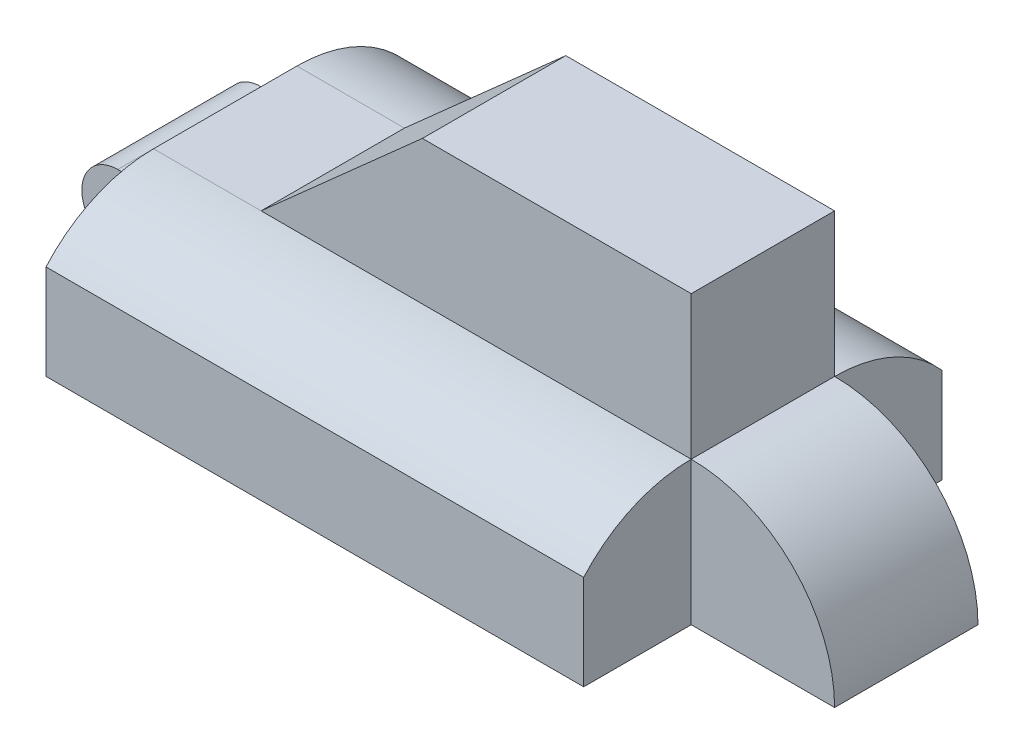
ISO-10303-21;
HEADER;
FILE_DESCRIPTION(('STEP AP214'),'2;1');
FILE_NAME('part.step','',(''),(''),'','','');
FILE_SCHEMA(('AUTOMOTIVE_DESIGN { 1 0 10303 214 1 1 1 1 }'));
ENDSEC;
DATA;
#1=APPLICATION_CONTEXT('core data for automotive mechanical design processes');
#2=APPLICATION_PROTOCOL_DEFINITION('international standard','automotive_design',2000,#1);
#3=PRODUCT_CONTEXT('',#1,'mechanical');
#4=PRODUCT('Part','Part','',(#3));
#5=PRODUCT_RELATED_PRODUCT_CATEGORY('part','',(#4));
#6=PRODUCT_DEFINITION_FORMATION('','',#4);
#7=PRODUCT_DEFINITION_CONTEXT('part definition',#1,'design');
#8=PRODUCT_DEFINITION('design','',#6,#7);
#9=PRODUCT_DEFINITION_SHAPE('','',#8);
#10=(LENGTH_UNIT() NAMED_UNIT(*) SI_UNIT(.MILLI.,.METRE.));
#11=(NAMED_UNIT(*) PLANE_ANGLE_UNIT() SI_UNIT($,.RADIAN.));
#12=(NAMED_UNIT(*) SI_UNIT($,.STERADIAN.) SOLID_ANGLE_UNIT());
#13=UNCERTAINTY_MEASURE_WITH_UNIT(LENGTH_MEASURE(1.E-05),#10,'distance_accuracy_value','');
#14=(GEOMETRIC_REPRESENTATION_CONTEXT(3) GLOBAL_UNCERTAINTY_ASSIGNED_CONTEXT((#13)) GLOBAL_UNIT_ASSIGNED_CONTEXT((#10,
#11,#12)) REPRESENTATION_CONTEXT('',''));
#15=CARTESIAN_POINT('',(0.,0.,0.));
#16=DIRECTION('',(0.,0.,1.));
#17=DIRECTION('',(1.,0.,0.));
#18=AXIS2_PLACEMENT_3D('',#15,#16,#17);
#19=CARTESIAN_POINT('',(-27.0923296058125,11.6573579031768,6.35));
#20=DIRECTION('',(0.,0.,-1.));
#21=DIRECTION('',(-1.,0.,0.));
#22=AXIS2_PLACEMENT_3D('',#19,#20,#21);
#23=PLANE('',#22);
#24=CARTESIAN_POINT('',(-23.9173296058125,14.8323579031768,6.35));
#25=DIRECTION('',(0.,0.,1.));
#26=DIRECTION('',(1.,0.,0.));
#27=AXIS2_PLACEMENT_3D('',#24,#25,#26);
#28=CIRCLE('',#27,1.27);
#29=CARTESIAN_POINT('',(-22.6473296058125,14.8323579031768,6.35));
#30=VERTEX_POINT('',#29);
#31=EDGE_CURVE('E413',#30,#30,#28,.T.);
#32=ORIENTED_EDGE('',*,*,#31,.F.);
#33=EDGE_LOOP('',(#32));
#34=FACE_BOUND('',#33,.T.);
#35=DIRECTION('',(1.,0.,0.));
#36=VECTOR('',#35,1.);
#37=CARTESIAN_POINT('',(-27.0923296058125,18.0073579031768,6.35));
#38=LINE('',#37,#36);
#39=CARTESIAN_POINT('',(-23.9173296058125,18.0073579031768,6.35));
#40=VERTEX_POINT('',#39);
#41=CARTESIAN_POINT('',(-20.7423296058125,18.0073579031768,6.35));
#42=VERTEX_POINT('',#41);
#43=EDGE_CURVE('E55',#40,#42,#38,.T.);
#44=ORIENTED_EDGE('',*,*,#43,.F.);
#45=CARTESIAN_POINT('',(-23.9173296058125,14.8323579031768,6.35));
#46=DIRECTION('',(0.,0.,1.));
#47=DIRECTION('',(1.,0.,0.));
#48=AXIS2_PLACEMENT_3D('',#45,#46,#47);
#49=CIRCLE('',#48,3.175);
#50=CARTESIAN_POINT('',(-23.9173296058125,11.6573579031768,6.35));
#51=VERTEX_POINT('',#50);
#52=EDGE_CURVE('E155',#40,#51,#49,.T.);
#53=ORIENTED_EDGE('',*,*,#52,.T.);
#54=DIRECTION('',(1.,0.,0.));
#55=VECTOR('',#54,1.);
#56=CARTESIAN_POINT('',(-27.0923296058125,11.6573579031768,6.35));
#57=LINE('',#56,#55);
#58=CARTESIAN_POINT('',(-20.7423296058125,11.6573579031768,6.35));
#59=VERTEX_POINT('',#58);
#60=EDGE_CURVE('E171',#51,#59,#57,.T.);
#61=ORIENTED_EDGE('',*,*,#60,.T.);
#62=DIRECTION('',(0.,1.,0.));
#63=VECTOR('',#62,1.);
#64=CARTESIAN_POINT('',(-20.7423296058125,11.6573579031768,6.35));
#65=LINE('',#64,#63);
#66=EDGE_CURVE('E423',#59,#42,#65,.T.);
#67=ORIENTED_EDGE('',*,*,#66,.T.);
#68=EDGE_LOOP('',(#44,#53,#61,#67));
#69=FACE_BOUND('',#68,.T.);
#70=ADVANCED_FACE('F39',(#34,#69),#23,.F.);
#71=CARTESIAN_POINT('',(-27.0923296058125,11.6573579031768,-6.35));
#72=DIRECTION('',(0.,0.,1.));
#73=DIRECTION('',(1.,0.,0.));
#74=AXIS2_PLACEMENT_3D('',#71,#72,#73);
#75=PLANE('',#74);
#76=CARTESIAN_POINT('',(-23.9173296058125,14.8323579031768,-6.35));
#77=DIRECTION('',(0.,0.,1.));
#78=DIRECTION('',(1.,0.,0.));
#79=AXIS2_PLACEMENT_3D('',#76,#77,#78);
#80=CIRCLE('',#79,1.27);
#81=CARTESIAN_POINT('',(-22.6473296058125,14.8323579031768,-6.35));
#82=VERTEX_POINT('',#81);
#83=EDGE_CURVE('E161',#82,#82,#80,.T.);
#84=ORIENTED_EDGE('',*,*,#83,.T.);
#85=EDGE_LOOP('',(#84));
#86=FACE_BOUND('',#85,.T.);
#87=CARTESIAN_POINT('',(-23.9173296058125,14.8323579031768,-6.35));
#88=DIRECTION('',(0.,0.,1.));
#89=DIRECTION('',(1.,0.,0.));
#90=AXIS2_PLACEMENT_3D('',#87,#88,#89);
#91=CIRCLE('',#90,3.175);
#92=CARTESIAN_POINT('',(-23.9173296058125,18.0073579031768,-6.35));
#93=VERTEX_POINT('',#92);
#94=CARTESIAN_POINT('',(-23.9173296058125,11.6573579031768,-6.35));
#95=VERTEX_POINT('',#94);
#96=EDGE_CURVE('E147',#93,#95,#91,.T.);
#97=ORIENTED_EDGE('',*,*,#96,.F.);
#98=DIRECTION('',(1.,0.,0.));
#99=VECTOR('',#98,1.);
#100=CARTESIAN_POINT('',(-27.0923296058125,18.0073579031768,-6.35));
#101=LINE('',#100,#99);
#102=CARTESIAN_POINT('',(-20.7423296058125,18.0073579031768,-6.35));
#103=VERTEX_POINT('',#102);
#104=EDGE_CURVE('E63',#93,#103,#101,.T.);
#105=ORIENTED_EDGE('',*,*,#104,.T.);
#106=DIRECTION('',(0.,-1.,0.));
#107=VECTOR('',#106,1.);
#108=CARTESIAN_POINT('',(-20.7423296058125,11.6573579031768,-6.35));
#109=LINE('',#108,#107);
#110=CARTESIAN_POINT('',(-20.7423296058125,11.6573579031768,-6.35));
#111=VERTEX_POINT('',#110);
#112=EDGE_CURVE('E429',#103,#111,#109,.T.);
#113=ORIENTED_EDGE('',*,*,#112,.T.);
#114=DIRECTION('',(1.,0.,0.));
#115=VECTOR('',#114,1.);
#116=CARTESIAN_POINT('',(-27.0923296058125,11.6573579031768,-6.35));
#117=LINE('',#116,#115);
#118=EDGE_CURVE('E150',#95,#111,#117,.T.);
#119=ORIENTED_EDGE('',*,*,#118,.F.);
#120=EDGE_LOOP('',(#97,#105,#113,#119));
#121=FACE_BOUND('',#120,.T.);
#122=ADVANCED_FACE('F149',(#86,#121),#75,.F.);
#123=CARTESIAN_POINT('',(-27.0923296058125,11.6573579031768,6.35));
#124=DIRECTION('',(0.,1.,0.));
#125=DIRECTION('',(0.,0.,1.));
#126=AXIS2_PLACEMENT_3D('',#123,#124,#125);
#127=PLANE('',#126);
#128=DIRECTION('',(0.,0.,1.));
#129=VECTOR('',#128,1.);
#130=CARTESIAN_POINT('',(-23.9173296058125,11.6573579031768,-6.35));
#131=LINE('',#130,#129);
#132=EDGE_CURVE('E154',#95,#51,#131,.T.);
#133=ORIENTED_EDGE('',*,*,#132,.F.);
#134=ORIENTED_EDGE('',*,*,#118,.T.);
#135=DIRECTION('',(0.,0.,1.));
#136=VECTOR('',#135,1.);
#137=CARTESIAN_POINT('',(-20.7423296058125,11.6573579031768,6.35));
#138=LINE('',#137,#136);
#139=EDGE_CURVE('E432',#111,#59,#138,.T.);
#140=ORIENTED_EDGE('',*,*,#139,.T.);
#141=ORIENTED_EDGE('',*,*,#60,.F.);
#142=EDGE_LOOP('',(#133,#134,#140,#141));
#143=FACE_BOUND('',#142,.T.);
#144=ADVANCED_FACE('F354',(#143),#127,.F.);
#145=CARTESIAN_POINT('',(-20.7423296058125,21.1823579031768,-15.875));
#146=DIRECTION('',(1.,0.,0.));
#147=DIRECTION('',(0.,0.,-1.));
#148=AXIS2_PLACEMENT_3D('',#145,#146,#147);
#149=PLANE('',#148);
#150=CARTESIAN_POINT('',(-20.7423296058125,8.48235790317684,6.35));
#151=DIRECTION('',(1.,0.,0.));
#152=DIRECTION('',(0.,0.,-1.));
#153=AXIS2_PLACEMENT_3D('',#150,#151,#152);
#154=CIRCLE('',#153,12.7);
#155=CARTESIAN_POINT('',(-20.7423296058125,21.1823579031768,6.35));
#156=VERTEX_POINT('',#155);
#157=CARTESIAN_POINT('',(-20.7423296058125,16.8826183158069,15.875));
#158=VERTEX_POINT('',#157);
#159=EDGE_CURVE('E175',#156,#158,#154,.T.);
#160=ORIENTED_EDGE('',*,*,#159,.F.);
#161=DIRECTION('',(0.,0.,1.));
#162=VECTOR('',#161,1.);
#163=CARTESIAN_POINT('',(-20.7423296058125,21.1823579031768,-15.875));
#164=LINE('',#163,#162);
#165=CARTESIAN_POINT('',(-20.7423296058125,21.1823579031768,-6.35));
#166=VERTEX_POINT('',#165);
#167=EDGE_CURVE('E274',#166,#156,#164,.T.);
#168=ORIENTED_EDGE('',*,*,#167,.F.);
#169=CARTESIAN_POINT('',(-20.7423296058125,8.48235790317684,-6.35));
#170=DIRECTION('',(-1.,0.,0.));
#171=DIRECTION('',(0.,0.,1.));
#172=AXIS2_PLACEMENT_3D('',#169,#170,#171);
#173=CIRCLE('',#172,12.7);
#174=CARTESIAN_POINT('',(-20.7423296058125,16.8826183158069,-15.875));
#175=VERTEX_POINT('',#174);
#176=EDGE_CURVE('E197',#166,#175,#173,.T.);
#177=ORIENTED_EDGE('',*,*,#176,.T.);
#178=DIRECTION('',(0.,-1.,0.));
#179=VECTOR('',#178,1.);
#180=CARTESIAN_POINT('',(-20.7423296058125,21.1823579031768,-15.875));
#181=LINE('',#180,#179);
#182=CARTESIAN_POINT('',(-20.7423296058125,8.48235790317684,-15.875));
#183=VERTEX_POINT('',#182);
#184=EDGE_CURVE('E11',#175,#183,#181,.T.);
#185=ORIENTED_EDGE('',*,*,#184,.T.);
#186=DIRECTION('',(0.,0.,1.));
#187=VECTOR('',#186,1.);
#188=CARTESIAN_POINT('',(-20.7423296058125,8.48235790317684,-15.875));
#189=LINE('',#188,#187);
#190=CARTESIAN_POINT('',(-20.7423296058125,8.48235790317684,15.875));
#191=VERTEX_POINT('',#190);
#192=EDGE_CURVE('E283',#183,#191,#189,.T.);
#193=ORIENTED_EDGE('',*,*,#192,.T.);
#194=DIRECTION('',(0.,-1.,0.));
#195=VECTOR('',#194,1.);
#196=CARTESIAN_POINT('',(-20.7423296058125,21.1823579031768,15.875));
#197=LINE('',#196,#195);
#198=EDGE_CURVE('E48',#158,#191,#197,.T.);
#199=ORIENTED_EDGE('',*,*,#198,.F.);
#200=EDGE_LOOP('',(#160,#168,#177,#185,#193,#199));
#201=FACE_BOUND('',#200,.T.);
#202=ORIENTED_EDGE('',*,*,#66,.F.);
#203=ORIENTED_EDGE('',*,*,#139,.F.);
#204=ORIENTED_EDGE('',*,*,#112,.F.);
#205=DIRECTION('',(0.,0.,-1.));
#206=VECTOR('',#205,1.);
#207=CARTESIAN_POINT('',(-20.7423296058125,18.0073579031768,6.35));
#208=LINE('',#207,#206);
#209=EDGE_CURVE('E164',#42,#103,#208,.T.);
#210=ORIENTED_EDGE('',*,*,#209,.F.);
#211=EDGE_LOOP('',(#202,#203,#204,#210));
#212=FACE_BOUND('',#211,.T.);
#213=ADVANCED_FACE('F309',(#201,#212),#149,.F.);
#214=CARTESIAN_POINT('',(26.8826703941875,21.1823579031768,-15.875));
#215=DIRECTION('',(1.,0.,0.));
#216=DIRECTION('',(0.,0.,-1.));
#217=AXIS2_PLACEMENT_3D('',#214,#215,#216);
#218=PLANE('',#217);
#219=DIRECTION('',(0.,-1.,0.));
#220=VECTOR('',#219,1.);
#221=CARTESIAN_POINT('',(26.8826703941875,21.1823579031768,6.34999999999999));
#222=LINE('',#221,#220);
#223=CARTESIAN_POINT('',(26.8826703941875,21.1823579031768,6.34999999999999));
#224=VERTEX_POINT('',#223);
#225=CARTESIAN_POINT('',(26.8826703941875,8.48235790317684,6.34999999999999));
#226=VERTEX_POINT('',#225);
#227=EDGE_CURVE('E206',#224,#226,#222,.T.);
#228=ORIENTED_EDGE('',*,*,#227,.F.);
#229=CARTESIAN_POINT('',(26.8826703941875,8.48235790317684,6.34999999999999));
#230=DIRECTION('',(1.,0.,0.));
#231=DIRECTION('',(0.,0.,-1.));
#232=AXIS2_PLACEMENT_3D('',#229,#230,#231);
#233=CIRCLE('',#232,12.7);
#234=CARTESIAN_POINT('',(26.8826703941875,16.8826183158069,15.875));
#235=VERTEX_POINT('',#234);
#236=EDGE_CURVE('E179',#224,#235,#233,.T.);
#237=ORIENTED_EDGE('',*,*,#236,.T.);
#238=DIRECTION('',(0.,-1.,0.));
#239=VECTOR('',#238,1.);
#240=CARTESIAN_POINT('',(26.8826703941875,21.1823579031768,15.875));
#241=LINE('',#240,#239);
#242=CARTESIAN_POINT('',(26.8826703941875,8.48235790317684,15.875));
#243=VERTEX_POINT('',#242);
#244=EDGE_CURVE('E297',#235,#243,#241,.T.);
#245=ORIENTED_EDGE('',*,*,#244,.T.);
#246=DIRECTION('',(0.,0.,1.));
#247=VECTOR('',#246,1.);
#248=CARTESIAN_POINT('',(26.8826703941875,8.48235790317684,-15.875));
#249=LINE('',#248,#247);
#250=EDGE_CURVE('E291',#226,#243,#249,.T.);
#251=ORIENTED_EDGE('',*,*,#250,.F.);
#252=EDGE_LOOP('',(#228,#237,#245,#251));
#253=FACE_BOUND('',#252,.T.);
#254=ADVANCED_FACE('F321',(#253),#218,.T.);
#255=CARTESIAN_POINT('',(26.8826703941875,21.1823579031768,15.875));
#256=DIRECTION('',(0.,0.,1.));
#257=DIRECTION('',(1.,0.,0.));
#258=AXIS2_PLACEMENT_3D('',#255,#256,#257);
#259=PLANE('',#258);
#260=ORIENTED_EDGE('',*,*,#244,.F.);
#261=DIRECTION('',(1.,0.,0.));
#262=VECTOR('',#261,1.);
#263=CARTESIAN_POINT('',(-20.7423296058125,16.8826183158069,15.875));
#264=LINE('',#263,#262);
#265=EDGE_CURVE('E178',#158,#235,#264,.T.);
#266=ORIENTED_EDGE('',*,*,#265,.F.);
#267=ORIENTED_EDGE('',*,*,#198,.T.);
#268=DIRECTION('',(-1.,0.,0.));
#269=VECTOR('',#268,1.);
#270=CARTESIAN_POINT('',(26.8826703941875,8.48235790317684,15.875));
#271=LINE('',#270,#269);
#272=EDGE_CURVE('E287',#243,#191,#271,.T.);
#273=ORIENTED_EDGE('',*,*,#272,.F.);
#274=EDGE_LOOP('',(#260,#266,#267,#273));
#275=FACE_BOUND('',#274,.T.);
#276=ADVANCED_FACE('F305',(#275),#259,.T.);
#277=CARTESIAN_POINT('',(26.8826703941875,8.48235790317684,-6.35000000000001));
#278=DIRECTION('',(-1.,0.,0.));
#279=DIRECTION('',(0.,0.,1.));
#280=AXIS2_PLACEMENT_3D('',#277,#278,#279);
#281=CIRCLE('',#280,12.7);
#282=CARTESIAN_POINT('',(26.8826703941875,21.1823579031768,-6.35000000000001));
#283=VERTEX_POINT('',#282);
#284=CARTESIAN_POINT('',(26.8826703941875,16.8826183158069,-15.875));
#285=VERTEX_POINT('',#284);
#286=EDGE_CURVE('E183',#283,#285,#281,.T.);
#287=ORIENTED_EDGE('',*,*,#286,.F.);
#288=DIRECTION('',(0.,1.,0.));
#289=VECTOR('',#288,1.);
#290=CARTESIAN_POINT('',(26.8826703941875,21.1823579031768,-6.35000000000001));
#291=LINE('',#290,#289);
#292=CARTESIAN_POINT('',(26.8826703941875,8.48235790317684,-6.35000000000001));
#293=VERTEX_POINT('',#292);
#294=EDGE_CURVE('E218',#293,#283,#291,.T.);
#295=ORIENTED_EDGE('',*,*,#294,.F.);
#296=CARTESIAN_POINT('',(26.8826703941875,8.48235790317684,-15.875));
#297=VERTEX_POINT('',#296);
#298=EDGE_CURVE('E279',#297,#293,#249,.T.);
#299=ORIENTED_EDGE('',*,*,#298,.F.);
#300=DIRECTION('',(0.,-1.,0.));
#301=VECTOR('',#300,1.);
#302=CARTESIAN_POINT('',(26.8826703941875,21.1823579031768,-15.875));
#303=LINE('',#302,#301);
#304=EDGE_CURVE('E278',#285,#297,#303,.T.);
#305=ORIENTED_EDGE('',*,*,#304,.F.);
#306=EDGE_LOOP('',(#287,#295,#299,#305));
#307=FACE_BOUND('',#306,.T.);
#308=ADVANCED_FACE('F344',(#307),#218,.T.);
#309=CARTESIAN_POINT('',(3.07017039418748,21.1823579031768,0.));
#310=DIRECTION('',(0.,1.,0.));
#311=DIRECTION('',(0.,0.,1.));
#312=AXIS2_PLACEMENT_3D('',#309,#310,#311);
#313=PLANE('',#312);
#314=ORIENTED_EDGE('',*,*,#167,.T.);
#315=DIRECTION('',(1.,0.,0.));
#316=VECTOR('',#315,1.);
#317=CARTESIAN_POINT('',(-20.7423296058125,21.1823579031768,6.35));
#318=LINE('',#317,#316);
#319=CARTESIAN_POINT('',(-11.2173296058125,21.1823579031768,6.35));
#320=VERTEX_POINT('',#319);
#321=EDGE_CURVE('E186',#156,#320,#318,.T.);
#322=ORIENTED_EDGE('',*,*,#321,.T.);
#323=DIRECTION('',(0.,0.,1.));
#324=VECTOR('',#323,1.);
#325=CARTESIAN_POINT('',(-11.2173296058125,21.1823579031768,6.35));
#326=LINE('',#325,#324);
#327=CARTESIAN_POINT('',(-11.2173296058125,21.1823579031768,-6.35));
#328=VERTEX_POINT('',#327);
#329=EDGE_CURVE('E243',#328,#320,#326,.T.);
#330=ORIENTED_EDGE('',*,*,#329,.F.);
#331=DIRECTION('',(1.,0.,0.));
#332=VECTOR('',#331,1.);
#333=CARTESIAN_POINT('',(-20.7423296058125,21.1823579031768,-6.35));
#334=LINE('',#333,#332);
#335=EDGE_CURVE('E194',#166,#328,#334,.T.);
#336=ORIENTED_EDGE('',*,*,#335,.F.);
#337=EDGE_LOOP('',(#314,#322,#330,#336));
#338=FACE_BOUND('',#337,.T.);
#339=ADVANCED_FACE('F335',(#338),#313,.T.);
#340=CARTESIAN_POINT('',(39.5826703941875,21.1823579031768,6.34999999999999));
#341=DIRECTION('',(0.,0.,-1.));
#342=DIRECTION('',(-1.,0.,0.));
#343=AXIS2_PLACEMENT_3D('',#340,#341,#342);
#344=PLANE('',#343);
#345=CARTESIAN_POINT('',(26.8826703941875,8.48235790317684,6.34999999999999));
#346=DIRECTION('',(0.,0.,-1.));
#347=DIRECTION('',(-1.,0.,0.));
#348=AXIS2_PLACEMENT_3D('',#345,#346,#347);
#349=CIRCLE('',#348,12.7);
#350=CARTESIAN_POINT('',(39.5826703941875,8.48235790317684,6.34999999999999));
#351=VERTEX_POINT('',#350);
#352=EDGE_CURVE('E203',#224,#351,#349,.T.);
#353=ORIENTED_EDGE('',*,*,#352,.F.);
#354=ORIENTED_EDGE('',*,*,#227,.T.);
#355=DIRECTION('',(-1.,0.,0.));
#356=VECTOR('',#355,1.);
#357=CARTESIAN_POINT('',(39.5826703941875,8.48235790317684,6.34999999999999));
#358=LINE('',#357,#356);
#359=EDGE_CURVE('E228',#351,#226,#358,.T.);
#360=ORIENTED_EDGE('',*,*,#359,.F.);
#361=EDGE_LOOP('',(#353,#354,#360));
#362=FACE_BOUND('',#361,.T.);
#363=ADVANCED_FACE('F332',(#362),#344,.F.);
#364=CARTESIAN_POINT('',(39.5826703941875,21.1823579031768,-6.35000000000001));
#365=DIRECTION('',(0.,0.,1.));
#366=DIRECTION('',(1.,0.,0.));
#367=AXIS2_PLACEMENT_3D('',#364,#365,#366);
#368=PLANE('',#367);
#369=CARTESIAN_POINT('',(26.8826703941875,8.48235790317684,-6.35000000000001));
#370=DIRECTION('',(0.,0.,-1.));
#371=DIRECTION('',(-1.,0.,0.));
#372=AXIS2_PLACEMENT_3D('',#369,#370,#371);
#373=CIRCLE('',#372,12.7);
#374=CARTESIAN_POINT('',(39.5826703941875,8.48235790317684,-6.35000000000001));
#375=VERTEX_POINT('',#374);
#376=EDGE_CURVE('E190',#283,#375,#373,.T.);
#377=ORIENTED_EDGE('',*,*,#376,.T.);
#378=DIRECTION('',(-1.,0.,0.));
#379=VECTOR('',#378,1.);
#380=CARTESIAN_POINT('',(39.5826703941875,8.48235790317684,-6.35000000000001));
#381=LINE('',#380,#379);
#382=EDGE_CURVE('E213',#375,#293,#381,.T.);
#383=ORIENTED_EDGE('',*,*,#382,.T.);
#384=ORIENTED_EDGE('',*,*,#294,.T.);
#385=EDGE_LOOP('',(#377,#383,#384));
#386=FACE_BOUND('',#385,.T.);
#387=ADVANCED_FACE('F334',(#386),#368,.F.);
#388=DIRECTION('',(0.,0.,1.));
#389=VECTOR('',#388,1.);
#390=CARTESIAN_POINT('',(26.8826703941875,21.1823579031768,6.34999999999999));
#391=LINE('',#390,#389);
#392=EDGE_CURVE('E214',#283,#224,#391,.T.);
#393=ORIENTED_EDGE('',*,*,#392,.F.);
#394=DIRECTION('',(0.,-1.,0.));
#395=VECTOR('',#394,1.);
#396=CARTESIAN_POINT('',(26.8826703941875,33.8823579031768,-6.35000000000001));
#397=LINE('',#396,#395);
#398=CARTESIAN_POINT('',(26.8826703941875,33.8823579031768,-6.35000000000001));
#399=VERTEX_POINT('',#398);
#400=EDGE_CURVE('E255',#399,#283,#397,.T.);
#401=ORIENTED_EDGE('',*,*,#400,.F.);
#402=DIRECTION('',(0.,0.,-1.));
#403=VECTOR('',#402,1.);
#404=CARTESIAN_POINT('',(26.8826703941875,33.8823579031768,6.34999999999999));
#405=LINE('',#404,#403);
#406=CARTESIAN_POINT('',(26.8826703941875,33.8823579031768,6.34999999999999));
#407=VERTEX_POINT('',#406);
#408=EDGE_CURVE('E247',#407,#399,#405,.T.);
#409=ORIENTED_EDGE('',*,*,#408,.F.);
#410=DIRECTION('',(0.,-1.,0.));
#411=VECTOR('',#410,1.);
#412=CARTESIAN_POINT('',(26.8826703941875,33.8823579031768,6.34999999999999));
#413=LINE('',#412,#411);
#414=EDGE_CURVE('E269',#407,#224,#413,.T.);
#415=ORIENTED_EDGE('',*,*,#414,.T.);
#416=EDGE_LOOP('',(#393,#401,#409,#415));
#417=FACE_BOUND('',#416,.T.);
#418=ADVANCED_FACE('F341',(#417),#218,.T.);
#419=CARTESIAN_POINT('',(26.8826703941875,21.1823579031768,-15.875));
#420=DIRECTION('',(0.,0.,1.));
#421=DIRECTION('',(1.,0.,0.));
#422=AXIS2_PLACEMENT_3D('',#419,#420,#421);
#423=PLANE('',#422);
#424=ORIENTED_EDGE('',*,*,#184,.F.);
#425=DIRECTION('',(1.,0.,0.));
#426=VECTOR('',#425,1.);
#427=CARTESIAN_POINT('',(-20.7423296058125,16.8826183158069,-15.875));
#428=LINE('',#427,#426);
#429=EDGE_CURVE('E169',#175,#285,#428,.T.);
#430=ORIENTED_EDGE('',*,*,#429,.T.);
#431=ORIENTED_EDGE('',*,*,#304,.T.);
#432=DIRECTION('',(-1.,0.,0.));
#433=VECTOR('',#432,1.);
#434=CARTESIAN_POINT('',(26.8826703941875,8.48235790317684,-15.875));
#435=LINE('',#434,#433);
#436=EDGE_CURVE('E273',#297,#183,#435,.T.);
#437=ORIENTED_EDGE('',*,*,#436,.T.);
#438=EDGE_LOOP('',(#424,#430,#431,#437));
#439=FACE_BOUND('',#438,.T.);
#440=ADVANCED_FACE('F41',(#439),#423,.F.);
#441=CARTESIAN_POINT('',(3.07017039418748,8.48235790317684,0.));
#442=DIRECTION('',(0.,1.,0.));
#443=DIRECTION('',(0.,0.,1.));
#444=AXIS2_PLACEMENT_3D('',#441,#442,#443);
#445=PLANE('',#444);
#446=ORIENTED_EDGE('',*,*,#436,.F.);
#447=ORIENTED_EDGE('',*,*,#298,.T.);
#448=ORIENTED_EDGE('',*,*,#382,.F.);
#449=DIRECTION('',(0.,0.,-1.));
#450=VECTOR('',#449,1.);
#451=CARTESIAN_POINT('',(39.5826703941875,8.48235790317684,6.34999999999999));
#452=LINE('',#451,#450);
#453=EDGE_CURVE('E210',#351,#375,#452,.T.);
#454=ORIENTED_EDGE('',*,*,#453,.F.);
#455=ORIENTED_EDGE('',*,*,#359,.T.);
#456=ORIENTED_EDGE('',*,*,#250,.T.);
#457=ORIENTED_EDGE('',*,*,#272,.T.);
#458=ORIENTED_EDGE('',*,*,#192,.F.);
#459=EDGE_LOOP('',(#446,#447,#448,#454,#455,#456,#457,#458));
#460=FACE_BOUND('',#459,.T.);
#461=ADVANCED_FACE('F315',(#460),#445,.F.);
#462=CARTESIAN_POINT('',(26.8826703941875,33.8823579031768,6.34999999999999));
#463=DIRECTION('',(0.,0.,-1.));
#464=DIRECTION('',(-1.,0.,0.));
#465=AXIS2_PLACEMENT_3D('',#462,#463,#464);
#466=PLANE('',#465);
#467=DIRECTION('',(1.,0.,0.));
#468=VECTOR('',#467,1.);
#469=CARTESIAN_POINT('',(26.8826703941875,33.8823579031768,6.34999999999999));
#470=LINE('',#469,#468);
#471=CARTESIAN_POINT('',(3.07017039418749,33.8823579031768,6.34999999999999));
#472=VERTEX_POINT('',#471);
#473=EDGE_CURVE('E244',#472,#407,#470,.T.);
#474=ORIENTED_EDGE('',*,*,#473,.F.);
#475=DIRECTION('',(0.74740931868366,0.66436383882992,0.));
#476=VECTOR('',#475,1.);
#477=CARTESIAN_POINT('',(-9.54224339891597,22.6713234204182,6.35));
#478=LINE('',#477,#476);
#479=EDGE_CURVE('E232',#320,#472,#478,.T.);
#480=ORIENTED_EDGE('',*,*,#479,.F.);
#481=DIRECTION('',(1.,0.,0.));
#482=VECTOR('',#481,1.);
#483=CARTESIAN_POINT('',(26.8826703941875,21.1823579031768,6.34999999999999));
#484=LINE('',#483,#482);
#485=EDGE_CURVE('E259',#320,#224,#484,.T.);
#486=ORIENTED_EDGE('',*,*,#485,.T.);
#487=ORIENTED_EDGE('',*,*,#414,.F.);
#488=EDGE_LOOP('',(#474,#480,#486,#487));
#489=FACE_BOUND('',#488,.T.);
#490=ADVANCED_FACE('F383',(#489),#466,.F.);
#491=CARTESIAN_POINT('',(26.8826703941875,33.8823579031768,-6.35000000000001));
#492=DIRECTION('',(0.,0.,1.));
#493=DIRECTION('',(1.,0.,0.));
#494=AXIS2_PLACEMENT_3D('',#491,#492,#493);
#495=PLANE('',#494);
#496=DIRECTION('',(-1.,0.,0.));
#497=VECTOR('',#496,1.);
#498=CARTESIAN_POINT('',(26.8826703941875,21.1823579031768,-6.35000000000001));
#499=LINE('',#498,#497);
#500=EDGE_CURVE('E248',#283,#328,#499,.T.);
#501=ORIENTED_EDGE('',*,*,#500,.T.);
#502=DIRECTION('',(0.74740931868366,0.66436383882992,0.));
#503=VECTOR('',#502,1.);
#504=CARTESIAN_POINT('',(-9.54224339891597,22.6713234204182,-6.35));
#505=LINE('',#504,#503);
#506=CARTESIAN_POINT('',(3.07017039418748,33.8823579031768,-6.35));
#507=VERTEX_POINT('',#506);
#508=EDGE_CURVE('E233',#328,#507,#505,.T.);
#509=ORIENTED_EDGE('',*,*,#508,.T.);
#510=DIRECTION('',(-1.,0.,0.));
#511=VECTOR('',#510,1.);
#512=CARTESIAN_POINT('',(26.8826703941875,33.8823579031768,-6.35000000000001));
#513=LINE('',#512,#511);
#514=EDGE_CURVE('E251',#399,#507,#513,.T.);
#515=ORIENTED_EDGE('',*,*,#514,.F.);
#516=ORIENTED_EDGE('',*,*,#400,.T.);
#517=EDGE_LOOP('',(#501,#509,#515,#516));
#518=FACE_BOUND('',#517,.T.);
#519=ADVANCED_FACE('F377',(#518),#495,.F.);
#520=CARTESIAN_POINT('',(3.07017039418748,33.8823579031768,0.));
#521=DIRECTION('',(0.,1.,0.));
#522=DIRECTION('',(0.,0.,1.));
#523=AXIS2_PLACEMENT_3D('',#520,#521,#522);
#524=PLANE('',#523);
#525=DIRECTION('',(0.,0.,1.));
#526=VECTOR('',#525,1.);
#527=CARTESIAN_POINT('',(3.07017039418748,33.8823579031768,-6.35));
#528=LINE('',#527,#526);
#529=EDGE_CURVE('E237',#507,#472,#528,.T.);
#530=ORIENTED_EDGE('',*,*,#529,.T.);
#531=ORIENTED_EDGE('',*,*,#473,.T.);
#532=ORIENTED_EDGE('',*,*,#408,.T.);
#533=ORIENTED_EDGE('',*,*,#514,.T.);
#534=EDGE_LOOP('',(#530,#531,#532,#533));
#535=FACE_BOUND('',#534,.T.);
#536=ADVANCED_FACE('F372',(#535),#524,.T.);
#537=CARTESIAN_POINT('',(-9.54224339891597,22.6713234204182,-6.35));
#538=DIRECTION('',(0.66436383882992,-0.74740931868366,0.));
#539=DIRECTION('',(0.74740931868366,0.66436383882992,0.));
#540=AXIS2_PLACEMENT_3D('',#537,#538,#539);
#541=PLANE('',#540);
#542=ORIENTED_EDGE('',*,*,#479,.T.);
#543=ORIENTED_EDGE('',*,*,#529,.F.);
#544=ORIENTED_EDGE('',*,*,#508,.F.);
#545=ORIENTED_EDGE('',*,*,#329,.T.);
#546=EDGE_LOOP('',(#542,#543,#544,#545));
#547=FACE_BOUND('',#546,.T.);
#548=ADVANCED_FACE('F368',(#547),#541,.F.);
#549=CARTESIAN_POINT('',(26.8826703941875,8.48235790317684,6.34999999999999));
#550=DIRECTION('',(0.,0.,-1.));
#551=DIRECTION('',(-1.,0.,0.));
#552=AXIS2_PLACEMENT_3D('',#549,#550,#551);
#553=CYLINDRICAL_SURFACE('',#552,12.7);
#554=ORIENTED_EDGE('',*,*,#376,.F.);
#555=ORIENTED_EDGE('',*,*,#392,.T.);
#556=ORIENTED_EDGE('',*,*,#352,.T.);
#557=ORIENTED_EDGE('',*,*,#453,.T.);
#558=EDGE_LOOP('',(#554,#555,#556,#557));
#559=FACE_BOUND('',#558,.T.);
#560=ADVANCED_FACE('F328',(#559),#553,.T.);
#561=CARTESIAN_POINT('',(-20.7423296058125,8.48235790317684,-6.35));
#562=DIRECTION('',(1.,0.,0.));
#563=DIRECTION('',(0.,0.,-1.));
#564=AXIS2_PLACEMENT_3D('',#561,#562,#563);
#565=CYLINDRICAL_SURFACE('',#564,12.7);
#566=ORIENTED_EDGE('',*,*,#286,.T.);
#567=ORIENTED_EDGE('',*,*,#429,.F.);
#568=ORIENTED_EDGE('',*,*,#176,.F.);
#569=ORIENTED_EDGE('',*,*,#335,.T.);
#570=ORIENTED_EDGE('',*,*,#500,.F.);
#571=EDGE_LOOP('',(#566,#567,#568,#569,#570));
#572=FACE_BOUND('',#571,.T.);
#573=ADVANCED_FACE('F363',(#572),#565,.T.);
#574=CARTESIAN_POINT('',(-20.7423296058125,8.48235790317684,6.35));
#575=DIRECTION('',(1.,0.,0.));
#576=DIRECTION('',(0.,0.,-1.));
#577=AXIS2_PLACEMENT_3D('',#574,#575,#576);
#578=CYLINDRICAL_SURFACE('',#577,12.7);
#579=ORIENTED_EDGE('',*,*,#236,.F.);
#580=ORIENTED_EDGE('',*,*,#485,.F.);
#581=ORIENTED_EDGE('',*,*,#321,.F.);
#582=ORIENTED_EDGE('',*,*,#159,.T.);
#583=ORIENTED_EDGE('',*,*,#265,.T.);
#584=EDGE_LOOP('',(#579,#580,#581,#582,#583));
#585=FACE_BOUND('',#584,.T.);
#586=ADVANCED_FACE('F323',(#585),#578,.T.);
#587=CARTESIAN_POINT('',(-27.0923296058125,18.0073579031768,6.35));
#588=DIRECTION('',(0.,-1.,0.));
#589=DIRECTION('',(0.,0.,-1.));
#590=AXIS2_PLACEMENT_3D('',#587,#588,#589);
#591=PLANE('',#590);
#592=ORIENTED_EDGE('',*,*,#104,.F.);
#593=DIRECTION('',(0.,0.,1.));
#594=VECTOR('',#593,1.);
#595=CARTESIAN_POINT('',(-23.9173296058125,18.0073579031768,-6.35));
#596=LINE('',#595,#594);
#597=EDGE_CURVE('E157',#93,#40,#596,.T.);
#598=ORIENTED_EDGE('',*,*,#597,.T.);
#599=ORIENTED_EDGE('',*,*,#43,.T.);
#600=ORIENTED_EDGE('',*,*,#209,.T.);
#601=EDGE_LOOP('',(#592,#598,#599,#600));
#602=FACE_BOUND('',#601,.T.);
#603=ADVANCED_FACE('F163',(#602),#591,.F.);
#604=CARTESIAN_POINT('',(-23.9173296058125,14.8323579031768,-6.35));
#605=DIRECTION('',(0.,0.,1.));
#606=DIRECTION('',(1.,0.,0.));
#607=AXIS2_PLACEMENT_3D('',#604,#605,#606);
#608=CYLINDRICAL_SURFACE('',#607,3.175);
#609=ORIENTED_EDGE('',*,*,#52,.F.);
#610=ORIENTED_EDGE('',*,*,#597,.F.);
#611=ORIENTED_EDGE('',*,*,#96,.T.);
#612=ORIENTED_EDGE('',*,*,#132,.T.);
#613=EDGE_LOOP('',(#609,#610,#611,#612));
#614=FACE_BOUND('',#613,.T.);
#615=ADVANCED_FACE('F158',(#614),#608,.T.);
#616=CARTESIAN_POINT('',(-23.9173296058125,14.8323579031768,-6.35));
#617=DIRECTION('',(0.,0.,1.));
#618=DIRECTION('',(1.,0.,0.));
#619=AXIS2_PLACEMENT_3D('',#616,#617,#618);
#620=CYLINDRICAL_SURFACE('',#619,1.27);
#621=ORIENTED_EDGE('',*,*,#83,.F.);
#622=EDGE_LOOP('',(#621));
#623=FACE_BOUND('',#622,.T.);
#624=ORIENTED_EDGE('',*,*,#31,.T.);
#625=EDGE_LOOP('',(#624));
#626=FACE_BOUND('',#625,.T.);
#627=ADVANCED_FACE('F404',(#623,#626),#620,.F.);
#628=CLOSED_SHELL('',(#70,#122,#144,#213,#254,#276,#308,#339,#363,#387,#418,#440,#461,#490,#519,
#536,#548,#560,#573,#586,#603,#615,#627));
#629=MANIFOLD_SOLID_BREP('B2',#628);
#630=ADVANCED_BREP_SHAPE_REPRESENTATION('',(#18,#629),#14);
#631=SHAPE_DEFINITION_REPRESENTATION(#9,#630);
ENDSEC;
END-ISO-10303-21;
